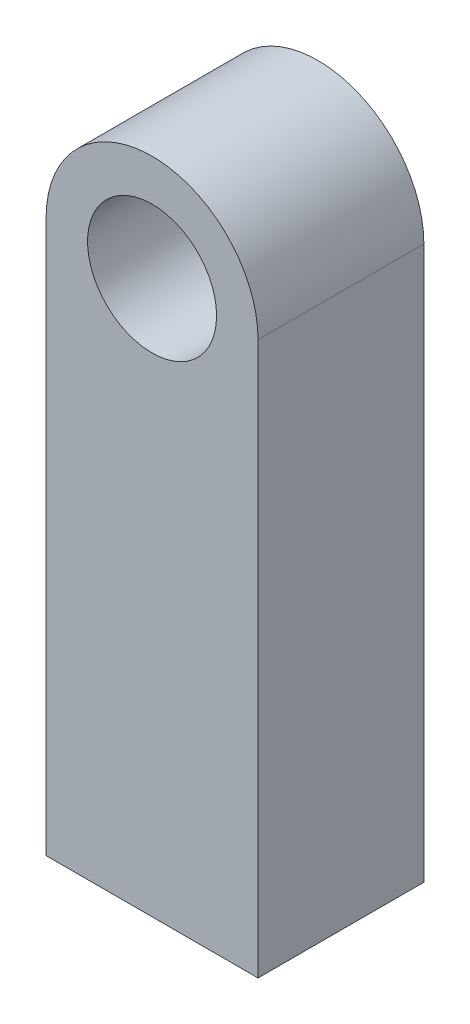
ISO-10303-21;
HEADER;
FILE_DESCRIPTION(('STEP AP214'),'2;1');
FILE_NAME('part.step','',(''),(''),'','','');
FILE_SCHEMA(('AUTOMOTIVE_DESIGN { 1 0 10303 214 1 1 1 1 }'));
ENDSEC;
DATA;
#1=APPLICATION_CONTEXT('core data for automotive mechanical design processes');
#2=APPLICATION_PROTOCOL_DEFINITION('international standard','automotive_design',2000,#1);
#3=PRODUCT_CONTEXT('',#1,'mechanical');
#4=PRODUCT('Part','Part','',(#3));
#5=PRODUCT_RELATED_PRODUCT_CATEGORY('part','',(#4));
#6=PRODUCT_DEFINITION_FORMATION('','',#4);
#7=PRODUCT_DEFINITION_CONTEXT('part definition',#1,'design');
#8=PRODUCT_DEFINITION('design','',#6,#7);
#9=PRODUCT_DEFINITION_SHAPE('','',#8);
#10=(LENGTH_UNIT() NAMED_UNIT(*) SI_UNIT(.MILLI.,.METRE.));
#11=(NAMED_UNIT(*) PLANE_ANGLE_UNIT() SI_UNIT($,.RADIAN.));
#12=(NAMED_UNIT(*) SI_UNIT($,.STERADIAN.) SOLID_ANGLE_UNIT());
#13=UNCERTAINTY_MEASURE_WITH_UNIT(LENGTH_MEASURE(1.E-05),#10,'distance_accuracy_value','');
#14=(GEOMETRIC_REPRESENTATION_CONTEXT(3) GLOBAL_UNCERTAINTY_ASSIGNED_CONTEXT((#13)) GLOBAL_UNIT_ASSIGNED_CONTEXT((#10,
#11,#12)) REPRESENTATION_CONTEXT('',''));
#15=CARTESIAN_POINT('',(0.,0.,0.));
#16=DIRECTION('',(0.,0.,1.));
#17=DIRECTION('',(1.,0.,0.));
#18=AXIS2_PLACEMENT_3D('',#15,#16,#17);
#19=CARTESIAN_POINT('',(0.,7.5,4.5));
#20=DIRECTION('',(0.,0.,-1.));
#21=DIRECTION('',(-1.,0.,0.));
#22=AXIS2_PLACEMENT_3D('',#19,#20,#21);
#23=PLANE('',#22);
#24=DIRECTION('',(0.,1.,0.));
#25=VECTOR('',#24,1.);
#26=CARTESIAN_POINT('',(2.875,7.5,4.5));
#27=LINE('',#26,#25);
#28=CARTESIAN_POINT('',(2.875,-7.5,4.5));
#29=VERTEX_POINT('',#28);
#30=CARTESIAN_POINT('',(2.875,7.5,4.5));
#31=VERTEX_POINT('',#30);
#32=EDGE_CURVE('E85',#29,#31,#27,.T.);
#33=ORIENTED_EDGE('',*,*,#32,.T.);
#34=CARTESIAN_POINT('',(0.,7.5,4.5));
#35=DIRECTION('',(0.,0.,1.));
#36=DIRECTION('',(-1.,0.,0.));
#37=AXIS2_PLACEMENT_3D('',#34,#35,#36);
#38=CIRCLE('',#37,2.875);
#39=CARTESIAN_POINT('',(-2.875,7.5,4.5));
#40=VERTEX_POINT('',#39);
#41=EDGE_CURVE('E80',#31,#40,#38,.T.);
#42=ORIENTED_EDGE('',*,*,#41,.T.);
#43=DIRECTION('',(0.,-1.,0.));
#44=VECTOR('',#43,1.);
#45=CARTESIAN_POINT('',(-2.875,7.5,4.5));
#46=LINE('',#45,#44);
#47=CARTESIAN_POINT('',(-2.875,-7.5,4.5));
#48=VERTEX_POINT('',#47);
#49=EDGE_CURVE('E83',#40,#48,#46,.T.);
#50=ORIENTED_EDGE('',*,*,#49,.T.);
#51=DIRECTION('',(1.,0.,0.));
#52=VECTOR('',#51,1.);
#53=CARTESIAN_POINT('',(-2.875,-7.5,4.5));
#54=LINE('',#53,#52);
#55=EDGE_CURVE('E50',#48,#29,#54,.T.);
#56=ORIENTED_EDGE('',*,*,#55,.T.);
#57=EDGE_LOOP('',(#33,#42,#50,#56));
#58=FACE_BOUND('',#57,.T.);
#59=CARTESIAN_POINT('',(0.,7.5,4.5));
#60=DIRECTION('',(0.,0.,1.));
#61=DIRECTION('',(1.,0.,0.));
#62=AXIS2_PLACEMENT_3D('',#59,#60,#61);
#63=CIRCLE('',#62,1.75);
#64=CARTESIAN_POINT('',(1.75,7.5,4.5));
#65=VERTEX_POINT('',#64);
#66=EDGE_CURVE('E100',#65,#65,#63,.T.);
#67=ORIENTED_EDGE('',*,*,#66,.F.);
#68=EDGE_LOOP('',(#67));
#69=FACE_BOUND('',#68,.T.);
#70=ADVANCED_FACE('F33',(#58,#69),#23,.F.);
#71=CARTESIAN_POINT('',(0.,7.5,0.));
#72=DIRECTION('',(0.,0.,-1.));
#73=DIRECTION('',(-1.,0.,0.));
#74=AXIS2_PLACEMENT_3D('',#71,#72,#73);
#75=PLANE('',#74);
#76=DIRECTION('',(0.,1.,0.));
#77=VECTOR('',#76,1.);
#78=CARTESIAN_POINT('',(2.875,7.5,0.));
#79=LINE('',#78,#77);
#80=CARTESIAN_POINT('',(2.875,-7.5,0.));
#81=VERTEX_POINT('',#80);
#82=CARTESIAN_POINT('',(2.875,7.5,0.));
#83=VERTEX_POINT('',#82);
#84=EDGE_CURVE('E97',#81,#83,#79,.T.);
#85=ORIENTED_EDGE('',*,*,#84,.F.);
#86=DIRECTION('',(1.,0.,0.));
#87=VECTOR('',#86,1.);
#88=CARTESIAN_POINT('',(-2.875,-7.5,0.));
#89=LINE('',#88,#87);
#90=CARTESIAN_POINT('',(-2.875,-7.5,0.));
#91=VERTEX_POINT('',#90);
#92=EDGE_CURVE('E73',#91,#81,#89,.T.);
#93=ORIENTED_EDGE('',*,*,#92,.F.);
#94=DIRECTION('',(0.,-1.,0.));
#95=VECTOR('',#94,1.);
#96=CARTESIAN_POINT('',(-2.875,7.5,0.));
#97=LINE('',#96,#95);
#98=CARTESIAN_POINT('',(-2.875,7.5,0.));
#99=VERTEX_POINT('',#98);
#100=EDGE_CURVE('E67',#99,#91,#97,.T.);
#101=ORIENTED_EDGE('',*,*,#100,.F.);
#102=CARTESIAN_POINT('',(0.,7.5,0.));
#103=DIRECTION('',(0.,0.,1.));
#104=DIRECTION('',(-1.,0.,0.));
#105=AXIS2_PLACEMENT_3D('',#102,#103,#104);
#106=CIRCLE('',#105,2.875);
#107=EDGE_CURVE('E89',#83,#99,#106,.T.);
#108=ORIENTED_EDGE('',*,*,#107,.F.);
#109=EDGE_LOOP('',(#85,#93,#101,#108));
#110=FACE_BOUND('',#109,.T.);
#111=CARTESIAN_POINT('',(0.,7.5,0.));
#112=DIRECTION('',(0.,0.,1.));
#113=DIRECTION('',(1.,0.,0.));
#114=AXIS2_PLACEMENT_3D('',#111,#112,#113);
#115=CIRCLE('',#114,1.75);
#116=CARTESIAN_POINT('',(1.75,7.5,0.));
#117=VERTEX_POINT('',#116);
#118=EDGE_CURVE('E112',#117,#117,#115,.T.);
#119=ORIENTED_EDGE('',*,*,#118,.T.);
#120=EDGE_LOOP('',(#119));
#121=FACE_BOUND('',#120,.T.);
#122=ADVANCED_FACE('F108',(#110,#121),#75,.T.);
#123=CARTESIAN_POINT('',(2.875,7.5,4.5));
#124=DIRECTION('',(-1.,0.,0.));
#125=DIRECTION('',(0.,-1.,0.));
#126=AXIS2_PLACEMENT_3D('',#123,#124,#125);
#127=PLANE('',#126);
#128=ORIENTED_EDGE('',*,*,#84,.T.);
#129=DIRECTION('',(0.,0.,-1.));
#130=VECTOR('',#129,1.);
#131=CARTESIAN_POINT('',(2.875,7.5,4.5));
#132=LINE('',#131,#130);
#133=EDGE_CURVE('E11',#31,#83,#132,.T.);
#134=ORIENTED_EDGE('',*,*,#133,.F.);
#135=ORIENTED_EDGE('',*,*,#32,.F.);
#136=DIRECTION('',(0.,0.,-1.));
#137=VECTOR('',#136,1.);
#138=CARTESIAN_POINT('',(2.875,-7.5,4.5));
#139=LINE('',#138,#137);
#140=EDGE_CURVE('E93',#29,#81,#139,.T.);
#141=ORIENTED_EDGE('',*,*,#140,.T.);
#142=EDGE_LOOP('',(#128,#134,#135,#141));
#143=FACE_BOUND('',#142,.T.);
#144=ADVANCED_FACE('F35',(#143),#127,.F.);
#145=CARTESIAN_POINT('',(0.,7.5,4.5));
#146=DIRECTION('',(0.,0.,-1.));
#147=DIRECTION('',(-1.,0.,0.));
#148=AXIS2_PLACEMENT_3D('',#145,#146,#147);
#149=CYLINDRICAL_SURFACE('',#148,2.875);
#150=ORIENTED_EDGE('',*,*,#107,.T.);
#151=DIRECTION('',(0.,0.,-1.));
#152=VECTOR('',#151,1.);
#153=CARTESIAN_POINT('',(-2.875,7.5,4.5));
#154=LINE('',#153,#152);
#155=EDGE_CURVE('E42',#40,#99,#154,.T.);
#156=ORIENTED_EDGE('',*,*,#155,.F.);
#157=ORIENTED_EDGE('',*,*,#41,.F.);
#158=ORIENTED_EDGE('',*,*,#133,.T.);
#159=EDGE_LOOP('',(#150,#156,#157,#158));
#160=FACE_BOUND('',#159,.T.);
#161=ADVANCED_FACE('F88',(#160),#149,.T.);
#162=CARTESIAN_POINT('',(-2.875,7.5,4.5));
#163=DIRECTION('',(1.,0.,0.));
#164=DIRECTION('',(0.,1.,0.));
#165=AXIS2_PLACEMENT_3D('',#162,#163,#164);
#166=PLANE('',#165);
#167=ORIENTED_EDGE('',*,*,#100,.T.);
#168=DIRECTION('',(0.,0.,-1.));
#169=VECTOR('',#168,1.);
#170=CARTESIAN_POINT('',(-2.875,-7.5,4.5));
#171=LINE('',#170,#169);
#172=EDGE_CURVE('E90',#48,#91,#171,.T.);
#173=ORIENTED_EDGE('',*,*,#172,.F.);
#174=ORIENTED_EDGE('',*,*,#49,.F.);
#175=ORIENTED_EDGE('',*,*,#155,.T.);
#176=EDGE_LOOP('',(#167,#173,#174,#175));
#177=FACE_BOUND('',#176,.T.);
#178=ADVANCED_FACE('F91',(#177),#166,.F.);
#179=CARTESIAN_POINT('',(-2.875,-7.5,4.5));
#180=DIRECTION('',(0.,1.,0.));
#181=DIRECTION('',(0.,0.,1.));
#182=AXIS2_PLACEMENT_3D('',#179,#180,#181);
#183=PLANE('',#182);
#184=ORIENTED_EDGE('',*,*,#92,.T.);
#185=ORIENTED_EDGE('',*,*,#140,.F.);
#186=ORIENTED_EDGE('',*,*,#55,.F.);
#187=ORIENTED_EDGE('',*,*,#172,.T.);
#188=EDGE_LOOP('',(#184,#185,#186,#187));
#189=FACE_BOUND('',#188,.T.);
#190=ADVANCED_FACE('F105',(#189),#183,.F.);
#191=CARTESIAN_POINT('',(0.,7.5,4.5));
#192=DIRECTION('',(0.,0.,-1.));
#193=DIRECTION('',(-1.,0.,0.));
#194=AXIS2_PLACEMENT_3D('',#191,#192,#193);
#195=CYLINDRICAL_SURFACE('',#194,1.75);
#196=ORIENTED_EDGE('',*,*,#66,.T.);
#197=EDGE_LOOP('',(#196));
#198=FACE_BOUND('',#197,.T.);
#199=ORIENTED_EDGE('',*,*,#118,.F.);
#200=EDGE_LOOP('',(#199));
#201=FACE_BOUND('',#200,.T.);
#202=ADVANCED_FACE('F118',(#198,#201),#195,.F.);
#203=CLOSED_SHELL('',(#70,#122,#144,#161,#178,#190,#202));
#204=MANIFOLD_SOLID_BREP('B2',#203);
#205=ADVANCED_BREP_SHAPE_REPRESENTATION('',(#18,#204),#14);
#206=SHAPE_DEFINITION_REPRESENTATION(#9,#205);
ENDSEC;
END-ISO-10303-21;
